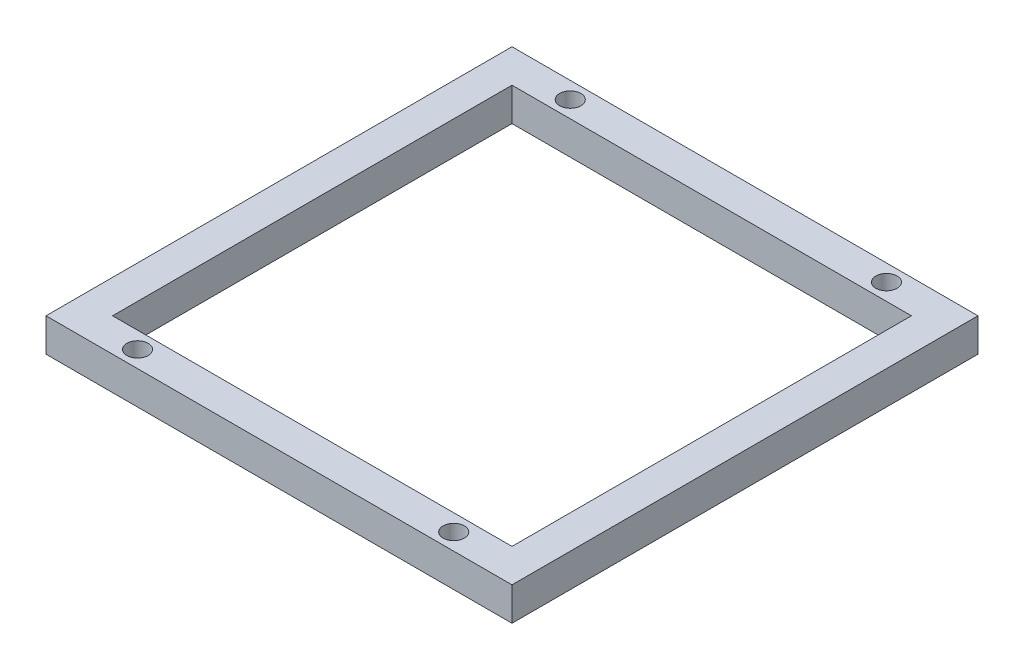
ISO-10303-21;
HEADER;
FILE_DESCRIPTION(('STEP AP214'),'2;1');
FILE_NAME('part.step','',(''),(''),'','','');
FILE_SCHEMA(('AUTOMOTIVE_DESIGN { 1 0 10303 214 1 1 1 1 }'));
ENDSEC;
DATA;
#1=APPLICATION_CONTEXT('core data for automotive mechanical design processes');
#2=APPLICATION_PROTOCOL_DEFINITION('international standard','automotive_design',2000,#1);
#3=PRODUCT_CONTEXT('',#1,'mechanical');
#4=PRODUCT('Part','Part','',(#3));
#5=PRODUCT_RELATED_PRODUCT_CATEGORY('part','',(#4));
#6=PRODUCT_DEFINITION_FORMATION('','',#4);
#7=PRODUCT_DEFINITION_CONTEXT('part definition',#1,'design');
#8=PRODUCT_DEFINITION('design','',#6,#7);
#9=PRODUCT_DEFINITION_SHAPE('','',#8);
#10=(LENGTH_UNIT() NAMED_UNIT(*) SI_UNIT(.MILLI.,.METRE.));
#11=(NAMED_UNIT(*) PLANE_ANGLE_UNIT() SI_UNIT($,.RADIAN.));
#12=(NAMED_UNIT(*) SI_UNIT($,.STERADIAN.) SOLID_ANGLE_UNIT());
#13=UNCERTAINTY_MEASURE_WITH_UNIT(LENGTH_MEASURE(1.E-05),#10,'distance_accuracy_value','');
#14=(GEOMETRIC_REPRESENTATION_CONTEXT(3) GLOBAL_UNCERTAINTY_ASSIGNED_CONTEXT((#13)) GLOBAL_UNIT_ASSIGNED_CONTEXT((#10,
#11,#12)) REPRESENTATION_CONTEXT('',''));
#15=CARTESIAN_POINT('',(0.,0.,0.));
#16=DIRECTION('',(0.,0.,1.));
#17=DIRECTION('',(1.,0.,0.));
#18=AXIS2_PLACEMENT_3D('',#15,#16,#17);
#19=CARTESIAN_POINT('',(0.,2.5,0.));
#20=DIRECTION('',(0.,-1.,0.));
#21=DIRECTION('',(0.,0.,-1.));
#22=AXIS2_PLACEMENT_3D('',#19,#20,#21);
#23=PLANE('',#22);
#24=DIRECTION('',(0.,0.,-1.));
#25=VECTOR('',#24,1.);
#26=CARTESIAN_POINT('',(35.,2.5,35.));
#27=LINE('',#26,#25);
#28=CARTESIAN_POINT('',(35.,2.5,35.));
#29=VERTEX_POINT('',#28);
#30=CARTESIAN_POINT('',(35.,2.5,-35.));
#31=VERTEX_POINT('',#30);
#32=EDGE_CURVE('E156',#29,#31,#27,.T.);
#33=ORIENTED_EDGE('',*,*,#32,.T.);
#34=DIRECTION('',(-1.,0.,0.));
#35=VECTOR('',#34,1.);
#36=CARTESIAN_POINT('',(-35.,2.5,-35.));
#37=LINE('',#36,#35);
#38=CARTESIAN_POINT('',(-35.,2.5,-35.));
#39=VERTEX_POINT('',#38);
#40=EDGE_CURVE('E160',#31,#39,#37,.T.);
#41=ORIENTED_EDGE('',*,*,#40,.T.);
#42=DIRECTION('',(0.,0.,1.));
#43=VECTOR('',#42,1.);
#44=CARTESIAN_POINT('',(-35.,2.5,35.));
#45=LINE('',#44,#43);
#46=CARTESIAN_POINT('',(-35.,2.5,35.));
#47=VERTEX_POINT('',#46);
#48=EDGE_CURVE('E164',#39,#47,#45,.T.);
#49=ORIENTED_EDGE('',*,*,#48,.T.);
#50=DIRECTION('',(1.,0.,0.));
#51=VECTOR('',#50,1.);
#52=CARTESIAN_POINT('',(-35.,2.5,35.));
#53=LINE('',#52,#51);
#54=EDGE_CURVE('E167',#47,#29,#53,.T.);
#55=ORIENTED_EDGE('',*,*,#54,.T.);
#56=EDGE_LOOP('',(#33,#41,#49,#55));
#57=FACE_BOUND('',#56,.T.);
#58=DIRECTION('',(0.,0.,1.));
#59=VECTOR('',#58,1.);
#60=CARTESIAN_POINT('',(-30.,2.5,30.));
#61=LINE('',#60,#59);
#62=CARTESIAN_POINT('',(-30.,2.5,-30.));
#63=VERTEX_POINT('',#62);
#64=CARTESIAN_POINT('',(-30.,2.5,30.));
#65=VERTEX_POINT('',#64);
#66=EDGE_CURVE('E105',#63,#65,#61,.T.);
#67=ORIENTED_EDGE('',*,*,#66,.F.);
#68=DIRECTION('',(-1.,0.,0.));
#69=VECTOR('',#68,1.);
#70=CARTESIAN_POINT('',(-30.,2.5,-30.));
#71=LINE('',#70,#69);
#72=CARTESIAN_POINT('',(30.,2.5,-30.));
#73=VERTEX_POINT('',#72);
#74=EDGE_CURVE('E132',#73,#63,#71,.T.);
#75=ORIENTED_EDGE('',*,*,#74,.F.);
#76=DIRECTION('',(0.,0.,-1.));
#77=VECTOR('',#76,1.);
#78=CARTESIAN_POINT('',(30.,2.5,30.));
#79=LINE('',#78,#77);
#80=CARTESIAN_POINT('',(30.,2.5,30.));
#81=VERTEX_POINT('',#80);
#82=EDGE_CURVE('E128',#81,#73,#79,.T.);
#83=ORIENTED_EDGE('',*,*,#82,.F.);
#84=DIRECTION('',(1.,0.,0.));
#85=VECTOR('',#84,1.);
#86=CARTESIAN_POINT('',(-30.,2.5,30.));
#87=LINE('',#86,#85);
#88=EDGE_CURVE('E114',#65,#81,#87,.T.);
#89=ORIENTED_EDGE('',*,*,#88,.F.);
#90=EDGE_LOOP('',(#67,#75,#83,#89));
#91=FACE_BOUND('',#90,.T.);
#92=CARTESIAN_POINT('',(-23.75,2.5,-32.5));
#93=DIRECTION('',(0.,1.,0.));
#94=DIRECTION('',(0.,0.,1.));
#95=AXIS2_PLACEMENT_3D('',#92,#93,#94);
#96=CIRCLE('',#95,1.6);
#97=CARTESIAN_POINT('',(-23.75,2.5,-30.9));
#98=VERTEX_POINT('',#97);
#99=EDGE_CURVE('E140',#98,#98,#96,.T.);
#100=ORIENTED_EDGE('',*,*,#99,.F.);
#101=EDGE_LOOP('',(#100));
#102=FACE_BOUND('',#101,.T.);
#103=CARTESIAN_POINT('',(23.75,2.5,-32.5));
#104=DIRECTION('',(0.,1.,0.));
#105=DIRECTION('',(0.,0.,1.));
#106=AXIS2_PLACEMENT_3D('',#103,#104,#105);
#107=CIRCLE('',#106,1.6);
#108=CARTESIAN_POINT('',(23.75,2.5,-30.9));
#109=VERTEX_POINT('',#108);
#110=EDGE_CURVE('E283',#109,#109,#107,.T.);
#111=ORIENTED_EDGE('',*,*,#110,.F.);
#112=EDGE_LOOP('',(#111));
#113=FACE_BOUND('',#112,.T.);
#114=CARTESIAN_POINT('',(23.75,2.5,32.5));
#115=DIRECTION('',(0.,1.,0.));
#116=DIRECTION('',(0.,0.,1.));
#117=AXIS2_PLACEMENT_3D('',#114,#115,#116);
#118=CIRCLE('',#117,1.6);
#119=CARTESIAN_POINT('',(23.75,2.5,34.1));
#120=VERTEX_POINT('',#119);
#121=EDGE_CURVE('E275',#120,#120,#118,.T.);
#122=ORIENTED_EDGE('',*,*,#121,.F.);
#123=EDGE_LOOP('',(#122));
#124=FACE_BOUND('',#123,.T.);
#125=CARTESIAN_POINT('',(-23.75,2.5,32.5));
#126=DIRECTION('',(0.,1.,0.));
#127=DIRECTION('',(0.,0.,1.));
#128=AXIS2_PLACEMENT_3D('',#125,#126,#127);
#129=CIRCLE('',#128,1.6);
#130=CARTESIAN_POINT('',(-23.75,2.5,34.1));
#131=VERTEX_POINT('',#130);
#132=EDGE_CURVE('E264',#131,#131,#129,.T.);
#133=ORIENTED_EDGE('',*,*,#132,.F.);
#134=EDGE_LOOP('',(#133));
#135=FACE_BOUND('',#134,.T.);
#136=ADVANCED_FACE('F39',(#57,#91,#102,#113,#124,#135),#23,.F.);
#137=CARTESIAN_POINT('',(0.,-2.5,0.));
#138=DIRECTION('',(0.,-1.,0.));
#139=DIRECTION('',(0.,0.,-1.));
#140=AXIS2_PLACEMENT_3D('',#137,#138,#139);
#141=PLANE('',#140);
#142=CARTESIAN_POINT('',(23.75,-2.5,32.5));
#143=DIRECTION('',(0.,1.,0.));
#144=DIRECTION('',(0.,0.,1.));
#145=AXIS2_PLACEMENT_3D('',#142,#143,#144);
#146=CIRCLE('',#145,1.6);
#147=CARTESIAN_POINT('',(23.75,-2.5,34.1));
#148=VERTEX_POINT('',#147);
#149=EDGE_CURVE('E272',#148,#148,#146,.T.);
#150=ORIENTED_EDGE('',*,*,#149,.T.);
#151=EDGE_LOOP('',(#150));
#152=FACE_BOUND('',#151,.T.);
#153=CARTESIAN_POINT('',(-23.75,-2.5,-32.5));
#154=DIRECTION('',(0.,1.,0.));
#155=DIRECTION('',(0.,0.,1.));
#156=AXIS2_PLACEMENT_3D('',#153,#154,#155);
#157=CIRCLE('',#156,1.6);
#158=CARTESIAN_POINT('',(-23.75,-2.5,-30.9));
#159=VERTEX_POINT('',#158);
#160=EDGE_CURVE('E287',#159,#159,#157,.T.);
#161=ORIENTED_EDGE('',*,*,#160,.T.);
#162=EDGE_LOOP('',(#161));
#163=FACE_BOUND('',#162,.T.);
#164=DIRECTION('',(0.,0.,-1.));
#165=VECTOR('',#164,1.);
#166=CARTESIAN_POINT('',(35.,-2.5,35.));
#167=LINE('',#166,#165);
#168=CARTESIAN_POINT('',(35.,-2.5,35.));
#169=VERTEX_POINT('',#168);
#170=CARTESIAN_POINT('',(35.,-2.5,-35.));
#171=VERTEX_POINT('',#170);
#172=EDGE_CURVE('E123',#169,#171,#167,.T.);
#173=ORIENTED_EDGE('',*,*,#172,.F.);
#174=DIRECTION('',(1.,0.,0.));
#175=VECTOR('',#174,1.);
#176=CARTESIAN_POINT('',(-35.,-2.5,35.));
#177=LINE('',#176,#175);
#178=CARTESIAN_POINT('',(-35.,-2.5,35.));
#179=VERTEX_POINT('',#178);
#180=EDGE_CURVE('E161',#179,#169,#177,.T.);
#181=ORIENTED_EDGE('',*,*,#180,.F.);
#182=DIRECTION('',(0.,0.,1.));
#183=VECTOR('',#182,1.);
#184=CARTESIAN_POINT('',(-35.,-2.5,35.));
#185=LINE('',#184,#183);
#186=CARTESIAN_POINT('',(-35.,-2.5,-35.));
#187=VERTEX_POINT('',#186);
#188=EDGE_CURVE('E177',#187,#179,#185,.T.);
#189=ORIENTED_EDGE('',*,*,#188,.F.);
#190=DIRECTION('',(-1.,0.,0.));
#191=VECTOR('',#190,1.);
#192=CARTESIAN_POINT('',(-35.,-2.5,-35.));
#193=LINE('',#192,#191);
#194=EDGE_CURVE('E174',#171,#187,#193,.T.);
#195=ORIENTED_EDGE('',*,*,#194,.F.);
#196=EDGE_LOOP('',(#173,#181,#189,#195));
#197=FACE_BOUND('',#196,.T.);
#198=DIRECTION('',(-1.,0.,0.));
#199=VECTOR('',#198,1.);
#200=CARTESIAN_POINT('',(-30.,-2.5,-30.));
#201=LINE('',#200,#199);
#202=CARTESIAN_POINT('',(30.,-2.5,-30.));
#203=VERTEX_POINT('',#202);
#204=CARTESIAN_POINT('',(-30.,-2.5,-30.));
#205=VERTEX_POINT('',#204);
#206=EDGE_CURVE('E115',#203,#205,#201,.T.);
#207=ORIENTED_EDGE('',*,*,#206,.T.);
#208=DIRECTION('',(0.,0.,1.));
#209=VECTOR('',#208,1.);
#210=CARTESIAN_POINT('',(-30.,-2.5,30.));
#211=LINE('',#210,#209);
#212=CARTESIAN_POINT('',(-30.,-2.5,30.));
#213=VERTEX_POINT('',#212);
#214=EDGE_CURVE('E63',#205,#213,#211,.T.);
#215=ORIENTED_EDGE('',*,*,#214,.T.);
#216=DIRECTION('',(1.,0.,0.));
#217=VECTOR('',#216,1.);
#218=CARTESIAN_POINT('',(-30.,-2.5,30.));
#219=LINE('',#218,#217);
#220=CARTESIAN_POINT('',(30.,-2.5,30.));
#221=VERTEX_POINT('',#220);
#222=EDGE_CURVE('E121',#213,#221,#219,.T.);
#223=ORIENTED_EDGE('',*,*,#222,.T.);
#224=DIRECTION('',(0.,0.,-1.));
#225=VECTOR('',#224,1.);
#226=CARTESIAN_POINT('',(30.,-2.5,30.));
#227=LINE('',#226,#225);
#228=EDGE_CURVE('E143',#221,#203,#227,.T.);
#229=ORIENTED_EDGE('',*,*,#228,.T.);
#230=EDGE_LOOP('',(#207,#215,#223,#229));
#231=FACE_BOUND('',#230,.T.);
#232=CARTESIAN_POINT('',(23.75,-2.5,-32.5));
#233=DIRECTION('',(0.,1.,0.));
#234=DIRECTION('',(0.,0.,1.));
#235=AXIS2_PLACEMENT_3D('',#232,#233,#234);
#236=CIRCLE('',#235,1.6);
#237=CARTESIAN_POINT('',(23.75,-2.5,-30.9));
#238=VERTEX_POINT('',#237);
#239=EDGE_CURVE('E279',#238,#238,#236,.T.);
#240=ORIENTED_EDGE('',*,*,#239,.T.);
#241=EDGE_LOOP('',(#240));
#242=FACE_BOUND('',#241,.T.);
#243=CARTESIAN_POINT('',(-23.75,-2.5,32.5));
#244=DIRECTION('',(0.,1.,0.));
#245=DIRECTION('',(0.,0.,1.));
#246=AXIS2_PLACEMENT_3D('',#243,#244,#245);
#247=CIRCLE('',#246,1.6);
#248=CARTESIAN_POINT('',(-23.75,-2.5,34.1));
#249=VERTEX_POINT('',#248);
#250=EDGE_CURVE('E267',#249,#249,#247,.T.);
#251=ORIENTED_EDGE('',*,*,#250,.T.);
#252=EDGE_LOOP('',(#251));
#253=FACE_BOUND('',#252,.T.);
#254=ADVANCED_FACE('F200',(#152,#163,#197,#231,#242,#253),#141,.T.);
#255=CARTESIAN_POINT('',(35.,2.5,35.));
#256=DIRECTION('',(-1.,0.,0.));
#257=DIRECTION('',(0.,0.,1.));
#258=AXIS2_PLACEMENT_3D('',#255,#256,#257);
#259=PLANE('',#258);
#260=ORIENTED_EDGE('',*,*,#172,.T.);
#261=DIRECTION('',(0.,-1.,0.));
#262=VECTOR('',#261,1.);
#263=CARTESIAN_POINT('',(35.,2.5,-35.));
#264=LINE('',#263,#262);
#265=EDGE_CURVE('E11',#31,#171,#264,.T.);
#266=ORIENTED_EDGE('',*,*,#265,.F.);
#267=ORIENTED_EDGE('',*,*,#32,.F.);
#268=DIRECTION('',(0.,-1.,0.));
#269=VECTOR('',#268,1.);
#270=CARTESIAN_POINT('',(35.,2.5,35.));
#271=LINE('',#270,#269);
#272=EDGE_CURVE('E170',#29,#169,#271,.T.);
#273=ORIENTED_EDGE('',*,*,#272,.T.);
#274=EDGE_LOOP('',(#260,#266,#267,#273));
#275=FACE_BOUND('',#274,.T.);
#276=ADVANCED_FACE('F41',(#275),#259,.F.);
#277=CARTESIAN_POINT('',(-35.,2.5,-35.));
#278=DIRECTION('',(0.,0.,1.));
#279=DIRECTION('',(1.,0.,0.));
#280=AXIS2_PLACEMENT_3D('',#277,#278,#279);
#281=PLANE('',#280);
#282=ORIENTED_EDGE('',*,*,#194,.T.);
#283=DIRECTION('',(0.,-1.,0.));
#284=VECTOR('',#283,1.);
#285=CARTESIAN_POINT('',(-35.,2.5,-35.));
#286=LINE('',#285,#284);
#287=EDGE_CURVE('E48',#39,#187,#286,.T.);
#288=ORIENTED_EDGE('',*,*,#287,.F.);
#289=ORIENTED_EDGE('',*,*,#40,.F.);
#290=ORIENTED_EDGE('',*,*,#265,.T.);
#291=EDGE_LOOP('',(#282,#288,#289,#290));
#292=FACE_BOUND('',#291,.T.);
#293=ADVANCED_FACE('F210',(#292),#281,.F.);
#294=CARTESIAN_POINT('',(-35.,2.5,35.));
#295=DIRECTION('',(1.,0.,0.));
#296=DIRECTION('',(0.,0.,-1.));
#297=AXIS2_PLACEMENT_3D('',#294,#295,#296);
#298=PLANE('',#297);
#299=ORIENTED_EDGE('',*,*,#188,.T.);
#300=DIRECTION('',(0.,-1.,0.));
#301=VECTOR('',#300,1.);
#302=CARTESIAN_POINT('',(-35.,2.5,35.));
#303=LINE('',#302,#301);
#304=EDGE_CURVE('E185',#47,#179,#303,.T.);
#305=ORIENTED_EDGE('',*,*,#304,.F.);
#306=ORIENTED_EDGE('',*,*,#48,.F.);
#307=ORIENTED_EDGE('',*,*,#287,.T.);
#308=EDGE_LOOP('',(#299,#305,#306,#307));
#309=FACE_BOUND('',#308,.T.);
#310=ADVANCED_FACE('F194',(#309),#298,.F.);
#311=CARTESIAN_POINT('',(-35.,2.5,35.));
#312=DIRECTION('',(0.,0.,-1.));
#313=DIRECTION('',(-1.,0.,0.));
#314=AXIS2_PLACEMENT_3D('',#311,#312,#313);
#315=PLANE('',#314);
#316=ORIENTED_EDGE('',*,*,#180,.T.);
#317=ORIENTED_EDGE('',*,*,#272,.F.);
#318=ORIENTED_EDGE('',*,*,#54,.F.);
#319=ORIENTED_EDGE('',*,*,#304,.T.);
#320=EDGE_LOOP('',(#316,#317,#318,#319));
#321=FACE_BOUND('',#320,.T.);
#322=ADVANCED_FACE('F204',(#321),#315,.F.);
#323=CARTESIAN_POINT('',(-30.,2.5,30.));
#324=DIRECTION('',(1.,0.,0.));
#325=DIRECTION('',(0.,0.,-1.));
#326=AXIS2_PLACEMENT_3D('',#323,#324,#325);
#327=PLANE('',#326);
#328=ORIENTED_EDGE('',*,*,#214,.F.);
#329=DIRECTION('',(0.,-1.,0.));
#330=VECTOR('',#329,1.);
#331=CARTESIAN_POINT('',(-30.,2.5,-30.));
#332=LINE('',#331,#330);
#333=EDGE_CURVE('E109',#63,#205,#332,.T.);
#334=ORIENTED_EDGE('',*,*,#333,.F.);
#335=ORIENTED_EDGE('',*,*,#66,.T.);
#336=DIRECTION('',(0.,-1.,0.));
#337=VECTOR('',#336,1.);
#338=CARTESIAN_POINT('',(-30.,2.5,30.));
#339=LINE('',#338,#337);
#340=EDGE_CURVE('E108',#65,#213,#339,.T.);
#341=ORIENTED_EDGE('',*,*,#340,.T.);
#342=EDGE_LOOP('',(#328,#334,#335,#341));
#343=FACE_BOUND('',#342,.T.);
#344=ADVANCED_FACE('F107',(#343),#327,.T.);
#345=CARTESIAN_POINT('',(-30.,2.5,30.));
#346=DIRECTION('',(0.,0.,-1.));
#347=DIRECTION('',(-1.,0.,0.));
#348=AXIS2_PLACEMENT_3D('',#345,#346,#347);
#349=PLANE('',#348);
#350=ORIENTED_EDGE('',*,*,#222,.F.);
#351=ORIENTED_EDGE('',*,*,#340,.F.);
#352=ORIENTED_EDGE('',*,*,#88,.T.);
#353=DIRECTION('',(0.,-1.,0.));
#354=VECTOR('',#353,1.);
#355=CARTESIAN_POINT('',(30.,2.5,30.));
#356=LINE('',#355,#354);
#357=EDGE_CURVE('E124',#81,#221,#356,.T.);
#358=ORIENTED_EDGE('',*,*,#357,.T.);
#359=EDGE_LOOP('',(#350,#351,#352,#358));
#360=FACE_BOUND('',#359,.T.);
#361=ADVANCED_FACE('F118',(#360),#349,.T.);
#362=CARTESIAN_POINT('',(30.,2.5,30.));
#363=DIRECTION('',(-1.,0.,0.));
#364=DIRECTION('',(0.,0.,1.));
#365=AXIS2_PLACEMENT_3D('',#362,#363,#364);
#366=PLANE('',#365);
#367=ORIENTED_EDGE('',*,*,#228,.F.);
#368=ORIENTED_EDGE('',*,*,#357,.F.);
#369=ORIENTED_EDGE('',*,*,#82,.T.);
#370=DIRECTION('',(0.,-1.,0.));
#371=VECTOR('',#370,1.);
#372=CARTESIAN_POINT('',(30.,2.5,-30.));
#373=LINE('',#372,#371);
#374=EDGE_CURVE('E55',#73,#203,#373,.T.);
#375=ORIENTED_EDGE('',*,*,#374,.T.);
#376=EDGE_LOOP('',(#367,#368,#369,#375));
#377=FACE_BOUND('',#376,.T.);
#378=ADVANCED_FACE('F234',(#377),#366,.T.);
#379=CARTESIAN_POINT('',(-30.,2.5,-30.));
#380=DIRECTION('',(0.,0.,1.));
#381=DIRECTION('',(1.,0.,0.));
#382=AXIS2_PLACEMENT_3D('',#379,#380,#381);
#383=PLANE('',#382);
#384=ORIENTED_EDGE('',*,*,#206,.F.);
#385=ORIENTED_EDGE('',*,*,#374,.F.);
#386=ORIENTED_EDGE('',*,*,#74,.T.);
#387=ORIENTED_EDGE('',*,*,#333,.T.);
#388=EDGE_LOOP('',(#384,#385,#386,#387));
#389=FACE_BOUND('',#388,.T.);
#390=ADVANCED_FACE('F238',(#389),#383,.T.);
#391=CARTESIAN_POINT('',(-23.75,2.5,-32.5));
#392=DIRECTION('',(0.,-1.,0.));
#393=DIRECTION('',(0.,0.,-1.));
#394=AXIS2_PLACEMENT_3D('',#391,#392,#393);
#395=CYLINDRICAL_SURFACE('',#394,1.6);
#396=ORIENTED_EDGE('',*,*,#99,.T.);
#397=EDGE_LOOP('',(#396));
#398=FACE_BOUND('',#397,.T.);
#399=ORIENTED_EDGE('',*,*,#160,.F.);
#400=EDGE_LOOP('',(#399));
#401=FACE_BOUND('',#400,.T.);
#402=ADVANCED_FACE('F244',(#398,#401),#395,.F.);
#403=CARTESIAN_POINT('',(23.75,2.5,-32.5));
#404=DIRECTION('',(0.,-1.,0.));
#405=DIRECTION('',(0.,0.,-1.));
#406=AXIS2_PLACEMENT_3D('',#403,#404,#405);
#407=CYLINDRICAL_SURFACE('',#406,1.6);
#408=ORIENTED_EDGE('',*,*,#110,.T.);
#409=EDGE_LOOP('',(#408));
#410=FACE_BOUND('',#409,.T.);
#411=ORIENTED_EDGE('',*,*,#239,.F.);
#412=EDGE_LOOP('',(#411));
#413=FACE_BOUND('',#412,.T.);
#414=ADVANCED_FACE('F247',(#410,#413),#407,.F.);
#415=CARTESIAN_POINT('',(23.75,2.5,32.5));
#416=DIRECTION('',(0.,-1.,0.));
#417=DIRECTION('',(0.,0.,-1.));
#418=AXIS2_PLACEMENT_3D('',#415,#416,#417);
#419=CYLINDRICAL_SURFACE('',#418,1.6);
#420=ORIENTED_EDGE('',*,*,#121,.T.);
#421=EDGE_LOOP('',(#420));
#422=FACE_BOUND('',#421,.T.);
#423=ORIENTED_EDGE('',*,*,#149,.F.);
#424=EDGE_LOOP('',(#423));
#425=FACE_BOUND('',#424,.T.);
#426=ADVANCED_FACE('F251',(#422,#425),#419,.F.);
#427=CARTESIAN_POINT('',(-23.75,2.5,32.5));
#428=DIRECTION('',(0.,-1.,0.));
#429=DIRECTION('',(0.,0.,-1.));
#430=AXIS2_PLACEMENT_3D('',#427,#428,#429);
#431=CYLINDRICAL_SURFACE('',#430,1.6);
#432=ORIENTED_EDGE('',*,*,#132,.T.);
#433=EDGE_LOOP('',(#432));
#434=FACE_BOUND('',#433,.T.);
#435=ORIENTED_EDGE('',*,*,#250,.F.);
#436=EDGE_LOOP('',(#435));
#437=FACE_BOUND('',#436,.T.);
#438=ADVANCED_FACE('F255',(#434,#437),#431,.F.);
#439=CLOSED_SHELL('',(#136,#254,#276,#293,#310,#322,#344,#361,#378,#390,#402,#414,#426,#438));
#440=MANIFOLD_SOLID_BREP('B2',#439);
#441=ADVANCED_BREP_SHAPE_REPRESENTATION('',(#18,#440),#14);
#442=SHAPE_DEFINITION_REPRESENTATION(#9,#441);
ENDSEC;
END-ISO-10303-21;
